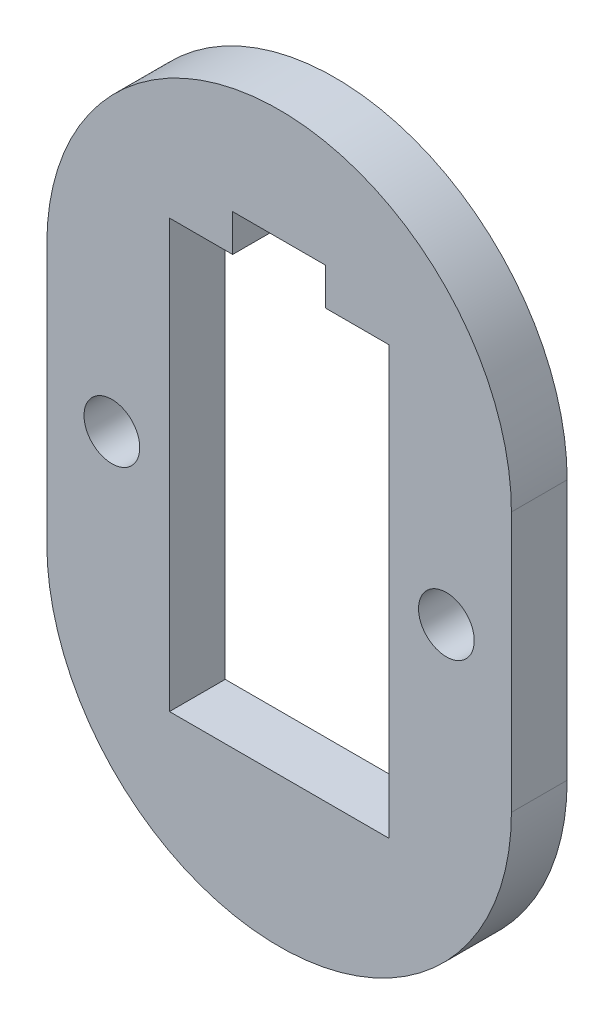
ISO-10303-21;
HEADER;
FILE_DESCRIPTION(('STEP AP214'),'2;1');
FILE_NAME('part.step','',(''),(''),'','','');
FILE_SCHEMA(('AUTOMOTIVE_DESIGN { 1 0 10303 214 1 1 1 1 }'));
ENDSEC;
DATA;
#1=APPLICATION_CONTEXT('core data for automotive mechanical design processes');
#2=APPLICATION_PROTOCOL_DEFINITION('international standard','automotive_design',2000,#1);
#3=PRODUCT_CONTEXT('',#1,'mechanical');
#4=PRODUCT('Part','Part','',(#3));
#5=PRODUCT_RELATED_PRODUCT_CATEGORY('part','',(#4));
#6=PRODUCT_DEFINITION_FORMATION('','',#4);
#7=PRODUCT_DEFINITION_CONTEXT('part definition',#1,'design');
#8=PRODUCT_DEFINITION('design','',#6,#7);
#9=PRODUCT_DEFINITION_SHAPE('','',#8);
#10=(LENGTH_UNIT() NAMED_UNIT(*) SI_UNIT(.MILLI.,.METRE.));
#11=(NAMED_UNIT(*) PLANE_ANGLE_UNIT() SI_UNIT($,.RADIAN.));
#12=(NAMED_UNIT(*) SI_UNIT($,.STERADIAN.) SOLID_ANGLE_UNIT());
#13=UNCERTAINTY_MEASURE_WITH_UNIT(LENGTH_MEASURE(1.E-05),#10,'distance_accuracy_value','');
#14=(GEOMETRIC_REPRESENTATION_CONTEXT(3) GLOBAL_UNCERTAINTY_ASSIGNED_CONTEXT((#13)) GLOBAL_UNIT_ASSIGNED_CONTEXT((#10,
#11,#12)) REPRESENTATION_CONTEXT('',''));
#15=CARTESIAN_POINT('',(0.,0.,0.));
#16=DIRECTION('',(0.,0.,1.));
#17=DIRECTION('',(1.,0.,0.));
#18=AXIS2_PLACEMENT_3D('',#15,#16,#17);
#19=CARTESIAN_POINT('',(52.,49.0000412262871,3.));
#20=DIRECTION('',(0.,0.,1.));
#21=DIRECTION('',(1.,0.,0.));
#22=AXIS2_PLACEMENT_3D('',#19,#20,#21);
#23=PLANE('',#22);
#24=CARTESIAN_POINT('',(42.9999999983334,41.9999912246797,3.));
#25=DIRECTION('',(0.,0.,1.));
#26=DIRECTION('',(1.,0.,0.));
#27=AXIS2_PLACEMENT_3D('',#24,#25,#26);
#28=CIRCLE('',#27,1.50000000166659);
#29=CARTESIAN_POINT('',(44.5,41.9999912246797,3.));
#30=VERTEX_POINT('',#29);
#31=EDGE_CURVE('E193',#30,#30,#28,.T.);
#32=ORIENTED_EDGE('',*,*,#31,.F.);
#33=EDGE_LOOP('',(#32));
#34=FACE_BOUND('',#33,.T.);
#35=CARTESIAN_POINT('',(52.,49.0000412262871,3.));
#36=DIRECTION('',(0.,0.,1.));
#37=DIRECTION('',(1.,0.,0.));
#38=AXIS2_PLACEMENT_3D('',#35,#36,#37);
#39=CIRCLE('',#38,12.5000000001);
#40=CARTESIAN_POINT('',(64.5,48.9999912261463,3.));
#41=VERTEX_POINT('',#40);
#42=CARTESIAN_POINT('',(39.5,49.000091226428,3.));
#43=VERTEX_POINT('',#42);
#44=EDGE_CURVE('E199',#41,#43,#39,.T.);
#45=ORIENTED_EDGE('',*,*,#44,.T.);
#46=DIRECTION('',(0.,-1.,0.));
#47=VECTOR('',#46,1.);
#48=CARTESIAN_POINT('',(39.5,49.000091226428,3.));
#49=LINE('',#48,#47);
#50=CARTESIAN_POINT('',(39.5,34.9999912252156,3.));
#51=VERTEX_POINT('',#50);
#52=EDGE_CURVE('E202',#43,#51,#49,.T.);
#53=ORIENTED_EDGE('',*,*,#52,.T.);
#54=CARTESIAN_POINT('',(52.,34.9999912252156,3.));
#55=DIRECTION('',(0.,0.,1.));
#56=DIRECTION('',(1.,0.,0.));
#57=AXIS2_PLACEMENT_3D('',#54,#55,#56);
#58=CIRCLE('',#57,12.5);
#59=CARTESIAN_POINT('',(64.5,34.9999912252156,3.));
#60=VERTEX_POINT('',#59);
#61=EDGE_CURVE('E205',#51,#60,#58,.T.);
#62=ORIENTED_EDGE('',*,*,#61,.T.);
#63=DIRECTION('',(0.,1.,0.));
#64=VECTOR('',#63,1.);
#65=CARTESIAN_POINT('',(64.5,48.9999912261463,3.));
#66=LINE('',#65,#64);
#67=EDGE_CURVE('E207',#60,#41,#66,.T.);
#68=ORIENTED_EDGE('',*,*,#67,.T.);
#69=EDGE_LOOP('',(#45,#53,#62,#68));
#70=FACE_BOUND('',#69,.T.);
#71=CARTESIAN_POINT('',(60.9999999983334,41.9999912246797,3.));
#72=DIRECTION('',(0.,0.,1.));
#73=DIRECTION('',(1.,0.,0.));
#74=AXIS2_PLACEMENT_3D('',#71,#72,#73);
#75=CIRCLE('',#74,1.50000000166663);
#76=CARTESIAN_POINT('',(62.5,41.9999912246797,3.));
#77=VERTEX_POINT('',#76);
#78=EDGE_CURVE('E187',#77,#77,#75,.T.);
#79=ORIENTED_EDGE('',*,*,#78,.F.);
#80=EDGE_LOOP('',(#79));
#81=FACE_BOUND('',#80,.T.);
#82=DIRECTION('',(0.,-1.,0.));
#83=VECTOR('',#82,1.);
#84=CARTESIAN_POINT('',(49.5,53.4999912263464,3.));
#85=LINE('',#84,#83);
#86=CARTESIAN_POINT('',(49.5,55.5000912263463,3.));
#87=VERTEX_POINT('',#86);
#88=CARTESIAN_POINT('',(49.5,53.4999912263464,3.));
#89=VERTEX_POINT('',#88);
#90=EDGE_CURVE('E130',#87,#89,#85,.T.);
#91=ORIENTED_EDGE('',*,*,#90,.F.);
#92=DIRECTION('',(-1.,0.,0.));
#93=VECTOR('',#92,1.);
#94=CARTESIAN_POINT('',(49.5,55.5000912263463,3.));
#95=LINE('',#94,#93);
#96=CARTESIAN_POINT('',(54.5,55.5000912263463,3.));
#97=VERTEX_POINT('',#96);
#98=EDGE_CURVE('E122',#97,#87,#95,.T.);
#99=ORIENTED_EDGE('',*,*,#98,.F.);
#100=DIRECTION('',(0.,1.,0.));
#101=VECTOR('',#100,1.);
#102=CARTESIAN_POINT('',(54.5,55.5000912263463,3.));
#103=LINE('',#102,#101);
#104=CARTESIAN_POINT('',(54.5,53.4999912263464,3.));
#105=VERTEX_POINT('',#104);
#106=EDGE_CURVE('E155',#105,#97,#103,.T.);
#107=ORIENTED_EDGE('',*,*,#106,.F.);
#108=DIRECTION('',(-1.,0.,0.));
#109=VECTOR('',#108,1.);
#110=CARTESIAN_POINT('',(54.5,53.4999912263464,3.));
#111=LINE('',#110,#109);
#112=CARTESIAN_POINT('',(57.9,53.4999912263464,3.));
#113=VERTEX_POINT('',#112);
#114=EDGE_CURVE('E153',#113,#105,#111,.T.);
#115=ORIENTED_EDGE('',*,*,#114,.F.);
#116=DIRECTION('',(0.,1.,0.));
#117=VECTOR('',#116,1.);
#118=CARTESIAN_POINT('',(57.9,30.4999912263463,3.));
#119=LINE('',#118,#117);
#120=CARTESIAN_POINT('',(57.9,30.4999912263463,3.));
#121=VERTEX_POINT('',#120);
#122=EDGE_CURVE('E151',#121,#113,#119,.T.);
#123=ORIENTED_EDGE('',*,*,#122,.F.);
#124=DIRECTION('',(1.,0.,0.));
#125=VECTOR('',#124,1.);
#126=CARTESIAN_POINT('',(46.1,30.4999912263463,3.));
#127=LINE('',#126,#125);
#128=CARTESIAN_POINT('',(46.1,30.4999912263463,3.));
#129=VERTEX_POINT('',#128);
#130=EDGE_CURVE('E149',#129,#121,#127,.T.);
#131=ORIENTED_EDGE('',*,*,#130,.F.);
#132=DIRECTION('',(0.,-1.,0.));
#133=VECTOR('',#132,1.);
#134=CARTESIAN_POINT('',(46.1,53.4999912263463,3.));
#135=LINE('',#134,#133);
#136=CARTESIAN_POINT('',(46.1,53.4999912263463,3.));
#137=VERTEX_POINT('',#136);
#138=EDGE_CURVE('E145',#137,#129,#135,.T.);
#139=ORIENTED_EDGE('',*,*,#138,.F.);
#140=DIRECTION('',(-1.,0.,0.));
#141=VECTOR('',#140,1.);
#142=CARTESIAN_POINT('',(46.1,53.4999912263463,3.));
#143=LINE('',#142,#141);
#144=EDGE_CURVE('E143',#89,#137,#143,.T.);
#145=ORIENTED_EDGE('',*,*,#144,.F.);
#146=EDGE_LOOP('',(#91,#99,#107,#115,#123,#131,#139,#145));
#147=FACE_BOUND('',#146,.T.);
#148=ADVANCED_FACE('F33',(#34,#70,#81,#147),#23,.T.);
#149=CARTESIAN_POINT('',(52.,49.0000412262871,0.));
#150=DIRECTION('',(0.,0.,1.));
#151=DIRECTION('',(1.,0.,0.));
#152=AXIS2_PLACEMENT_3D('',#149,#150,#151);
#153=PLANE('',#152);
#154=CARTESIAN_POINT('',(60.9999999983334,41.9999912246797,0.));
#155=DIRECTION('',(0.,0.,1.));
#156=DIRECTION('',(1.,0.,0.));
#157=AXIS2_PLACEMENT_3D('',#154,#155,#156);
#158=CIRCLE('',#157,1.50000000166663);
#159=CARTESIAN_POINT('',(62.5,41.9999912246797,0.));
#160=VERTEX_POINT('',#159);
#161=EDGE_CURVE('E138',#160,#160,#158,.T.);
#162=ORIENTED_EDGE('',*,*,#161,.T.);
#163=EDGE_LOOP('',(#162));
#164=FACE_BOUND('',#163,.T.);
#165=CARTESIAN_POINT('',(42.9999999983334,41.9999912246797,0.));
#166=DIRECTION('',(0.,0.,1.));
#167=DIRECTION('',(1.,0.,0.));
#168=AXIS2_PLACEMENT_3D('',#165,#166,#167);
#169=CIRCLE('',#168,1.50000000166659);
#170=CARTESIAN_POINT('',(44.5,41.9999912246797,0.));
#171=VERTEX_POINT('',#170);
#172=EDGE_CURVE('E190',#171,#171,#169,.T.);
#173=ORIENTED_EDGE('',*,*,#172,.T.);
#174=EDGE_LOOP('',(#173));
#175=FACE_BOUND('',#174,.T.);
#176=CARTESIAN_POINT('',(52.,49.0000412262871,0.));
#177=DIRECTION('',(0.,0.,1.));
#178=DIRECTION('',(1.,0.,0.));
#179=AXIS2_PLACEMENT_3D('',#176,#177,#178);
#180=CIRCLE('',#179,12.5000000001);
#181=CARTESIAN_POINT('',(64.5,48.9999912261463,0.));
#182=VERTEX_POINT('',#181);
#183=CARTESIAN_POINT('',(39.5,49.000091226428,0.));
#184=VERTEX_POINT('',#183);
#185=EDGE_CURVE('E196',#182,#184,#180,.T.);
#186=ORIENTED_EDGE('',*,*,#185,.F.);
#187=DIRECTION('',(0.,1.,0.));
#188=VECTOR('',#187,1.);
#189=CARTESIAN_POINT('',(64.5,48.9999912261463,0.));
#190=LINE('',#189,#188);
#191=CARTESIAN_POINT('',(64.5,34.9999912252156,0.));
#192=VERTEX_POINT('',#191);
#193=EDGE_CURVE('E203',#192,#182,#190,.T.);
#194=ORIENTED_EDGE('',*,*,#193,.F.);
#195=CARTESIAN_POINT('',(52.,34.9999912252156,0.));
#196=DIRECTION('',(0.,0.,1.));
#197=DIRECTION('',(1.,0.,0.));
#198=AXIS2_PLACEMENT_3D('',#195,#196,#197);
#199=CIRCLE('',#198,12.5);
#200=CARTESIAN_POINT('',(39.5,34.9999912252156,0.));
#201=VERTEX_POINT('',#200);
#202=EDGE_CURVE('E214',#201,#192,#199,.T.);
#203=ORIENTED_EDGE('',*,*,#202,.F.);
#204=DIRECTION('',(0.,-1.,0.));
#205=VECTOR('',#204,1.);
#206=CARTESIAN_POINT('',(39.5,49.000091226428,0.));
#207=LINE('',#206,#205);
#208=EDGE_CURVE('E212',#184,#201,#207,.T.);
#209=ORIENTED_EDGE('',*,*,#208,.F.);
#210=EDGE_LOOP('',(#186,#194,#203,#209));
#211=FACE_BOUND('',#210,.T.);
#212=DIRECTION('',(-1.,0.,0.));
#213=VECTOR('',#212,1.);
#214=CARTESIAN_POINT('',(49.5,55.5000912263463,0.));
#215=LINE('',#214,#213);
#216=CARTESIAN_POINT('',(54.5,55.5000912263463,0.));
#217=VERTEX_POINT('',#216);
#218=CARTESIAN_POINT('',(49.5,55.5000912263463,0.));
#219=VERTEX_POINT('',#218);
#220=EDGE_CURVE('E56',#217,#219,#215,.T.);
#221=ORIENTED_EDGE('',*,*,#220,.T.);
#222=DIRECTION('',(0.,-1.,0.));
#223=VECTOR('',#222,1.);
#224=CARTESIAN_POINT('',(49.5,53.4999912263464,0.));
#225=LINE('',#224,#223);
#226=CARTESIAN_POINT('',(49.5,53.4999912263464,0.));
#227=VERTEX_POINT('',#226);
#228=EDGE_CURVE('E137',#219,#227,#225,.T.);
#229=ORIENTED_EDGE('',*,*,#228,.T.);
#230=DIRECTION('',(-1.,0.,0.));
#231=VECTOR('',#230,1.);
#232=CARTESIAN_POINT('',(46.1,53.4999912263463,0.));
#233=LINE('',#232,#231);
#234=CARTESIAN_POINT('',(46.1,53.4999912263463,0.));
#235=VERTEX_POINT('',#234);
#236=EDGE_CURVE('E159',#227,#235,#233,.T.);
#237=ORIENTED_EDGE('',*,*,#236,.T.);
#238=DIRECTION('',(0.,-1.,0.));
#239=VECTOR('',#238,1.);
#240=CARTESIAN_POINT('',(46.1,53.4999912263463,0.));
#241=LINE('',#240,#239);
#242=CARTESIAN_POINT('',(46.1,30.4999912263463,0.));
#243=VERTEX_POINT('',#242);
#244=EDGE_CURVE('E162',#235,#243,#241,.T.);
#245=ORIENTED_EDGE('',*,*,#244,.T.);
#246=DIRECTION('',(1.,0.,0.));
#247=VECTOR('',#246,1.);
#248=CARTESIAN_POINT('',(46.1,30.4999912263463,0.));
#249=LINE('',#248,#247);
#250=CARTESIAN_POINT('',(57.9,30.4999912263463,0.));
#251=VERTEX_POINT('',#250);
#252=EDGE_CURVE('E165',#243,#251,#249,.T.);
#253=ORIENTED_EDGE('',*,*,#252,.T.);
#254=DIRECTION('',(0.,1.,0.));
#255=VECTOR('',#254,1.);
#256=CARTESIAN_POINT('',(57.9,30.4999912263463,0.));
#257=LINE('',#256,#255);
#258=CARTESIAN_POINT('',(57.9,53.4999912263464,0.));
#259=VERTEX_POINT('',#258);
#260=EDGE_CURVE('E168',#251,#259,#257,.T.);
#261=ORIENTED_EDGE('',*,*,#260,.T.);
#262=DIRECTION('',(-1.,0.,0.));
#263=VECTOR('',#262,1.);
#264=CARTESIAN_POINT('',(54.5,53.4999912263464,0.));
#265=LINE('',#264,#263);
#266=CARTESIAN_POINT('',(54.5,53.4999912263464,0.));
#267=VERTEX_POINT('',#266);
#268=EDGE_CURVE('E171',#259,#267,#265,.T.);
#269=ORIENTED_EDGE('',*,*,#268,.T.);
#270=DIRECTION('',(0.,1.,0.));
#271=VECTOR('',#270,1.);
#272=CARTESIAN_POINT('',(54.5,55.5000912263463,0.));
#273=LINE('',#272,#271);
#274=EDGE_CURVE('E131',#267,#217,#273,.T.);
#275=ORIENTED_EDGE('',*,*,#274,.T.);
#276=EDGE_LOOP('',(#221,#229,#237,#245,#253,#261,#269,#275));
#277=FACE_BOUND('',#276,.T.);
#278=ADVANCED_FACE('F232',(#164,#175,#211,#277),#153,.F.);
#279=CARTESIAN_POINT('',(52.,49.0000412262871,3.));
#280=DIRECTION('',(0.,0.,-1.));
#281=DIRECTION('',(-1.,0.,0.));
#282=AXIS2_PLACEMENT_3D('',#279,#280,#281);
#283=CYLINDRICAL_SURFACE('',#282,12.5000000001);
#284=ORIENTED_EDGE('',*,*,#185,.T.);
#285=DIRECTION('',(0.,0.,-1.));
#286=VECTOR('',#285,1.);
#287=CARTESIAN_POINT('',(39.5,49.000091226428,3.));
#288=LINE('',#287,#286);
#289=EDGE_CURVE('E11',#43,#184,#288,.T.);
#290=ORIENTED_EDGE('',*,*,#289,.F.);
#291=ORIENTED_EDGE('',*,*,#44,.F.);
#292=DIRECTION('',(0.,0.,-1.));
#293=VECTOR('',#292,1.);
#294=CARTESIAN_POINT('',(64.5,48.9999912261463,3.));
#295=LINE('',#294,#293);
#296=EDGE_CURVE('E209',#41,#182,#295,.T.);
#297=ORIENTED_EDGE('',*,*,#296,.T.);
#298=EDGE_LOOP('',(#284,#290,#291,#297));
#299=FACE_BOUND('',#298,.T.);
#300=ADVANCED_FACE('F35',(#299),#283,.T.);
#301=CARTESIAN_POINT('',(39.5,49.000091226428,3.));
#302=DIRECTION('',(1.,0.,0.));
#303=DIRECTION('',(0.,1.,0.));
#304=AXIS2_PLACEMENT_3D('',#301,#302,#303);
#305=PLANE('',#304);
#306=ORIENTED_EDGE('',*,*,#208,.T.);
#307=DIRECTION('',(0.,0.,-1.));
#308=VECTOR('',#307,1.);
#309=CARTESIAN_POINT('',(39.5,34.9999912252156,3.));
#310=LINE('',#309,#308);
#311=EDGE_CURVE('E41',#51,#201,#310,.T.);
#312=ORIENTED_EDGE('',*,*,#311,.F.);
#313=ORIENTED_EDGE('',*,*,#52,.F.);
#314=ORIENTED_EDGE('',*,*,#289,.T.);
#315=EDGE_LOOP('',(#306,#312,#313,#314));
#316=FACE_BOUND('',#315,.T.);
#317=ADVANCED_FACE('F243',(#316),#305,.F.);
#318=CARTESIAN_POINT('',(52.,34.9999912252156,3.));
#319=DIRECTION('',(0.,0.,-1.));
#320=DIRECTION('',(-1.,0.,0.));
#321=AXIS2_PLACEMENT_3D('',#318,#319,#320);
#322=CYLINDRICAL_SURFACE('',#321,12.5);
#323=ORIENTED_EDGE('',*,*,#202,.T.);
#324=DIRECTION('',(0.,0.,-1.));
#325=VECTOR('',#324,1.);
#326=CARTESIAN_POINT('',(64.5,34.9999912252156,3.));
#327=LINE('',#326,#325);
#328=EDGE_CURVE('E219',#60,#192,#327,.T.);
#329=ORIENTED_EDGE('',*,*,#328,.F.);
#330=ORIENTED_EDGE('',*,*,#61,.F.);
#331=ORIENTED_EDGE('',*,*,#311,.T.);
#332=EDGE_LOOP('',(#323,#329,#330,#331));
#333=FACE_BOUND('',#332,.T.);
#334=ADVANCED_FACE('F226',(#333),#322,.T.);
#335=CARTESIAN_POINT('',(64.5,48.9999912261463,3.));
#336=DIRECTION('',(-1.,0.,0.));
#337=DIRECTION('',(0.,0.,1.));
#338=AXIS2_PLACEMENT_3D('',#335,#336,#337);
#339=PLANE('',#338);
#340=ORIENTED_EDGE('',*,*,#193,.T.);
#341=ORIENTED_EDGE('',*,*,#296,.F.);
#342=ORIENTED_EDGE('',*,*,#67,.F.);
#343=ORIENTED_EDGE('',*,*,#328,.T.);
#344=EDGE_LOOP('',(#340,#341,#342,#343));
#345=FACE_BOUND('',#344,.T.);
#346=ADVANCED_FACE('F236',(#345),#339,.F.);
#347=CARTESIAN_POINT('',(42.9999999983334,41.9999912246797,3.));
#348=DIRECTION('',(0.,0.,-1.));
#349=DIRECTION('',(-1.,0.,0.));
#350=AXIS2_PLACEMENT_3D('',#347,#348,#349);
#351=CYLINDRICAL_SURFACE('',#350,1.50000000166659);
#352=ORIENTED_EDGE('',*,*,#31,.T.);
#353=EDGE_LOOP('',(#352));
#354=FACE_BOUND('',#353,.T.);
#355=ORIENTED_EDGE('',*,*,#172,.F.);
#356=EDGE_LOOP('',(#355));
#357=FACE_BOUND('',#356,.T.);
#358=ADVANCED_FACE('F260',(#354,#357),#351,.F.);
#359=CARTESIAN_POINT('',(60.9999999983334,41.9999912246797,3.));
#360=DIRECTION('',(0.,0.,-1.));
#361=DIRECTION('',(-1.,0.,0.));
#362=AXIS2_PLACEMENT_3D('',#359,#360,#361);
#363=CYLINDRICAL_SURFACE('',#362,1.50000000166663);
#364=ORIENTED_EDGE('',*,*,#78,.T.);
#365=EDGE_LOOP('',(#364));
#366=FACE_BOUND('',#365,.T.);
#367=ORIENTED_EDGE('',*,*,#161,.F.);
#368=EDGE_LOOP('',(#367));
#369=FACE_BOUND('',#368,.T.);
#370=ADVANCED_FACE('F267',(#366,#369),#363,.F.);
#371=CARTESIAN_POINT('',(49.5,55.5000912263463,3.));
#372=DIRECTION('',(0.,-1.,0.));
#373=DIRECTION('',(1.,0.,0.));
#374=AXIS2_PLACEMENT_3D('',#371,#372,#373);
#375=PLANE('',#374);
#376=ORIENTED_EDGE('',*,*,#220,.F.);
#377=DIRECTION('',(0.,0.,-1.));
#378=VECTOR('',#377,1.);
#379=CARTESIAN_POINT('',(54.5,55.5000912263463,3.));
#380=LINE('',#379,#378);
#381=EDGE_CURVE('E126',#97,#217,#380,.T.);
#382=ORIENTED_EDGE('',*,*,#381,.F.);
#383=ORIENTED_EDGE('',*,*,#98,.T.);
#384=DIRECTION('',(0.,0.,-1.));
#385=VECTOR('',#384,1.);
#386=CARTESIAN_POINT('',(49.5,55.5000912263463,3.));
#387=LINE('',#386,#385);
#388=EDGE_CURVE('E125',#87,#219,#387,.T.);
#389=ORIENTED_EDGE('',*,*,#388,.T.);
#390=EDGE_LOOP('',(#376,#382,#383,#389));
#391=FACE_BOUND('',#390,.T.);
#392=ADVANCED_FACE('F124',(#391),#375,.T.);
#393=CARTESIAN_POINT('',(49.5,53.4999912263464,3.));
#394=DIRECTION('',(1.,0.,0.));
#395=DIRECTION('',(0.,0.,-1.));
#396=AXIS2_PLACEMENT_3D('',#393,#394,#395);
#397=PLANE('',#396);
#398=ORIENTED_EDGE('',*,*,#228,.F.);
#399=ORIENTED_EDGE('',*,*,#388,.F.);
#400=ORIENTED_EDGE('',*,*,#90,.T.);
#401=DIRECTION('',(0.,0.,-1.));
#402=VECTOR('',#401,1.);
#403=CARTESIAN_POINT('',(49.5,53.4999912263464,3.));
#404=LINE('',#403,#402);
#405=EDGE_CURVE('E139',#89,#227,#404,.T.);
#406=ORIENTED_EDGE('',*,*,#405,.T.);
#407=EDGE_LOOP('',(#398,#399,#400,#406));
#408=FACE_BOUND('',#407,.T.);
#409=ADVANCED_FACE('F134',(#408),#397,.T.);
#410=CARTESIAN_POINT('',(46.1,53.4999912263463,3.));
#411=DIRECTION('',(0.,-1.,0.));
#412=DIRECTION('',(1.,0.,0.));
#413=AXIS2_PLACEMENT_3D('',#410,#411,#412);
#414=PLANE('',#413);
#415=ORIENTED_EDGE('',*,*,#236,.F.);
#416=ORIENTED_EDGE('',*,*,#405,.F.);
#417=ORIENTED_EDGE('',*,*,#144,.T.);
#418=DIRECTION('',(0.,0.,-1.));
#419=VECTOR('',#418,1.);
#420=CARTESIAN_POINT('',(46.1,53.4999912263463,3.));
#421=LINE('',#420,#419);
#422=EDGE_CURVE('E184',#137,#235,#421,.T.);
#423=ORIENTED_EDGE('',*,*,#422,.T.);
#424=EDGE_LOOP('',(#415,#416,#417,#423));
#425=FACE_BOUND('',#424,.T.);
#426=ADVANCED_FACE('F284',(#425),#414,.T.);
#427=CARTESIAN_POINT('',(46.1,53.4999912263463,3.));
#428=DIRECTION('',(1.,0.,0.));
#429=DIRECTION('',(0.,0.,-1.));
#430=AXIS2_PLACEMENT_3D('',#427,#428,#429);
#431=PLANE('',#430);
#432=ORIENTED_EDGE('',*,*,#244,.F.);
#433=ORIENTED_EDGE('',*,*,#422,.F.);
#434=ORIENTED_EDGE('',*,*,#138,.T.);
#435=DIRECTION('',(0.,0.,-1.));
#436=VECTOR('',#435,1.);
#437=CARTESIAN_POINT('',(46.1,30.4999912263463,3.));
#438=LINE('',#437,#436);
#439=EDGE_CURVE('E182',#129,#243,#438,.T.);
#440=ORIENTED_EDGE('',*,*,#439,.T.);
#441=EDGE_LOOP('',(#432,#433,#434,#440));
#442=FACE_BOUND('',#441,.T.);
#443=ADVANCED_FACE('F287',(#442),#431,.T.);
#444=CARTESIAN_POINT('',(46.1,30.4999912263463,3.));
#445=DIRECTION('',(0.,1.,0.));
#446=DIRECTION('',(-1.,0.,0.));
#447=AXIS2_PLACEMENT_3D('',#444,#445,#446);
#448=PLANE('',#447);
#449=ORIENTED_EDGE('',*,*,#252,.F.);
#450=ORIENTED_EDGE('',*,*,#439,.F.);
#451=ORIENTED_EDGE('',*,*,#130,.T.);
#452=DIRECTION('',(0.,0.,-1.));
#453=VECTOR('',#452,1.);
#454=CARTESIAN_POINT('',(57.9,30.4999912263463,3.));
#455=LINE('',#454,#453);
#456=EDGE_CURVE('E180',#121,#251,#455,.T.);
#457=ORIENTED_EDGE('',*,*,#456,.T.);
#458=EDGE_LOOP('',(#449,#450,#451,#457));
#459=FACE_BOUND('',#458,.T.);
#460=ADVANCED_FACE('F291',(#459),#448,.T.);
#461=CARTESIAN_POINT('',(57.9,30.4999912263463,3.));
#462=DIRECTION('',(-1.,0.,0.));
#463=DIRECTION('',(0.,0.,1.));
#464=AXIS2_PLACEMENT_3D('',#461,#462,#463);
#465=PLANE('',#464);
#466=ORIENTED_EDGE('',*,*,#260,.F.);
#467=ORIENTED_EDGE('',*,*,#456,.F.);
#468=ORIENTED_EDGE('',*,*,#122,.T.);
#469=DIRECTION('',(0.,0.,-1.));
#470=VECTOR('',#469,1.);
#471=CARTESIAN_POINT('',(57.9,53.4999912263464,3.));
#472=LINE('',#471,#470);
#473=EDGE_CURVE('E178',#113,#259,#472,.T.);
#474=ORIENTED_EDGE('',*,*,#473,.T.);
#475=EDGE_LOOP('',(#466,#467,#468,#474));
#476=FACE_BOUND('',#475,.T.);
#477=ADVANCED_FACE('F295',(#476),#465,.T.);
#478=CARTESIAN_POINT('',(54.5,53.4999912263464,3.));
#479=DIRECTION('',(0.,-1.,0.));
#480=DIRECTION('',(1.,0.,0.));
#481=AXIS2_PLACEMENT_3D('',#478,#479,#480);
#482=PLANE('',#481);
#483=ORIENTED_EDGE('',*,*,#268,.F.);
#484=ORIENTED_EDGE('',*,*,#473,.F.);
#485=ORIENTED_EDGE('',*,*,#114,.T.);
#486=DIRECTION('',(0.,0.,-1.));
#487=VECTOR('',#486,1.);
#488=CARTESIAN_POINT('',(54.5,53.4999912263464,3.));
#489=LINE('',#488,#487);
#490=EDGE_CURVE('E48',#105,#267,#489,.T.);
#491=ORIENTED_EDGE('',*,*,#490,.T.);
#492=EDGE_LOOP('',(#483,#484,#485,#491));
#493=FACE_BOUND('',#492,.T.);
#494=ADVANCED_FACE('F299',(#493),#482,.T.);
#495=CARTESIAN_POINT('',(54.5,55.5000912263463,3.));
#496=DIRECTION('',(-1.,0.,0.));
#497=DIRECTION('',(0.,0.,1.));
#498=AXIS2_PLACEMENT_3D('',#495,#496,#497);
#499=PLANE('',#498);
#500=ORIENTED_EDGE('',*,*,#274,.F.);
#501=ORIENTED_EDGE('',*,*,#490,.F.);
#502=ORIENTED_EDGE('',*,*,#106,.T.);
#503=ORIENTED_EDGE('',*,*,#381,.T.);
#504=EDGE_LOOP('',(#500,#501,#502,#503));
#505=FACE_BOUND('',#504,.T.);
#506=ADVANCED_FACE('F303',(#505),#499,.T.);
#507=CLOSED_SHELL('',(#148,#278,#300,#317,#334,#346,#358,#370,#392,#409,#426,#443,#460,#477,
#494,#506));
#508=MANIFOLD_SOLID_BREP('B2',#507);
#509=ADVANCED_BREP_SHAPE_REPRESENTATION('',(#18,#508),#14);
#510=SHAPE_DEFINITION_REPRESENTATION(#9,#509);
ENDSEC;
END-ISO-10303-21;
